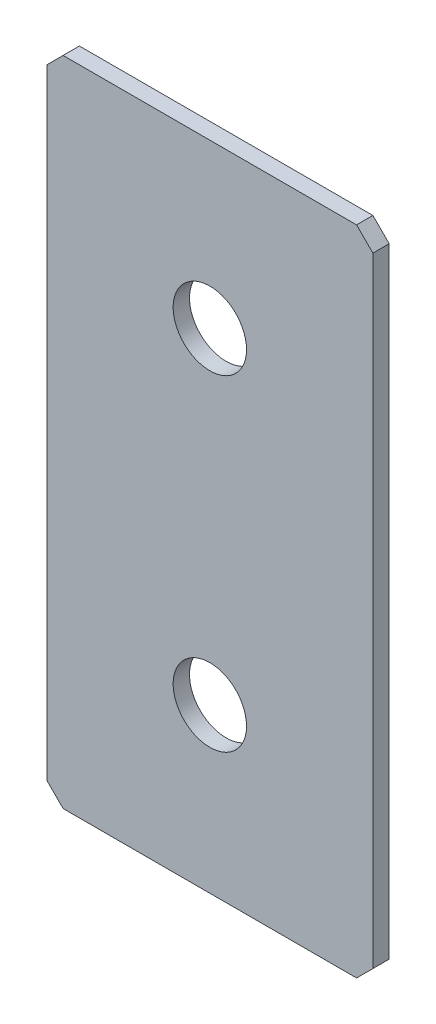
ISO-10303-21;
HEADER;
FILE_DESCRIPTION(('STEP AP214'),'2;1');
FILE_NAME('part.step','',(''),(''),'','','');
FILE_SCHEMA(('AUTOMOTIVE_DESIGN { 1 0 10303 214 1 1 1 1 }'));
ENDSEC;
DATA;
#1=APPLICATION_CONTEXT('core data for automotive mechanical design processes');
#2=APPLICATION_PROTOCOL_DEFINITION('international standard','automotive_design',2000,#1);
#3=PRODUCT_CONTEXT('',#1,'mechanical');
#4=PRODUCT('Part','Part','',(#3));
#5=PRODUCT_RELATED_PRODUCT_CATEGORY('part','',(#4));
#6=PRODUCT_DEFINITION_FORMATION('','',#4);
#7=PRODUCT_DEFINITION_CONTEXT('part definition',#1,'design');
#8=PRODUCT_DEFINITION('design','',#6,#7);
#9=PRODUCT_DEFINITION_SHAPE('','',#8);
#10=(LENGTH_UNIT() NAMED_UNIT(*) SI_UNIT(.MILLI.,.METRE.));
#11=(NAMED_UNIT(*) PLANE_ANGLE_UNIT() SI_UNIT($,.RADIAN.));
#12=(NAMED_UNIT(*) SI_UNIT($,.STERADIAN.) SOLID_ANGLE_UNIT());
#13=UNCERTAINTY_MEASURE_WITH_UNIT(LENGTH_MEASURE(1.E-05),#10,'distance_accuracy_value','');
#14=(GEOMETRIC_REPRESENTATION_CONTEXT(3) GLOBAL_UNCERTAINTY_ASSIGNED_CONTEXT((#13)) GLOBAL_UNIT_ASSIGNED_CONTEXT((#10,
#11,#12)) REPRESENTATION_CONTEXT('',''));
#15=CARTESIAN_POINT('',(0.,0.,0.));
#16=DIRECTION('',(0.,0.,1.));
#17=DIRECTION('',(1.,0.,0.));
#18=AXIS2_PLACEMENT_3D('',#15,#16,#17);
#19=CARTESIAN_POINT('',(20.,-40.,2.));
#20=DIRECTION('',(-1.,0.,0.));
#21=DIRECTION('',(0.,0.,1.));
#22=AXIS2_PLACEMENT_3D('',#19,#20,#21);
#23=PLANE('',#22);
#24=DIRECTION('',(0.,1.,0.));
#25=VECTOR('',#24,1.);
#26=CARTESIAN_POINT('',(20.,-40.,2.));
#27=LINE('',#26,#25);
#28=CARTESIAN_POINT('',(20.,-38.,2.));
#29=VERTEX_POINT('',#28);
#30=CARTESIAN_POINT('',(20.,38.,2.));
#31=VERTEX_POINT('',#30);
#32=EDGE_CURVE('E128',#29,#31,#27,.T.);
#33=ORIENTED_EDGE('',*,*,#32,.F.);
#34=DIRECTION('',(0.,0.,-1.));
#35=VECTOR('',#34,1.);
#36=CARTESIAN_POINT('',(20.,-38.,2.));
#37=LINE('',#36,#35);
#38=CARTESIAN_POINT('',(20.,-38.,0.));
#39=VERTEX_POINT('',#38);
#40=EDGE_CURVE('E154',#29,#39,#37,.T.);
#41=ORIENTED_EDGE('',*,*,#40,.T.);
#42=DIRECTION('',(0.,1.,0.));
#43=VECTOR('',#42,1.);
#44=CARTESIAN_POINT('',(20.,-40.,0.));
#45=LINE('',#44,#43);
#46=CARTESIAN_POINT('',(20.,38.,0.));
#47=VERTEX_POINT('',#46);
#48=EDGE_CURVE('E162',#39,#47,#45,.T.);
#49=ORIENTED_EDGE('',*,*,#48,.T.);
#50=DIRECTION('',(0.,0.,1.));
#51=VECTOR('',#50,1.);
#52=CARTESIAN_POINT('',(20.,38.,2.));
#53=LINE('',#52,#51);
#54=EDGE_CURVE('E152',#47,#31,#53,.T.);
#55=ORIENTED_EDGE('',*,*,#54,.T.);
#56=EDGE_LOOP('',(#33,#41,#49,#55));
#57=FACE_BOUND('',#56,.T.);
#58=ADVANCED_FACE('F37',(#57),#23,.F.);
#59=CARTESIAN_POINT('',(-20.,40.,2.));
#60=DIRECTION('',(0.,-1.,0.));
#61=DIRECTION('',(0.,0.,-1.));
#62=AXIS2_PLACEMENT_3D('',#59,#60,#61);
#63=PLANE('',#62);
#64=DIRECTION('',(-1.,0.,0.));
#65=VECTOR('',#64,1.);
#66=CARTESIAN_POINT('',(-20.,40.,0.));
#67=LINE('',#66,#65);
#68=CARTESIAN_POINT('',(18.,40.,0.));
#69=VERTEX_POINT('',#68);
#70=CARTESIAN_POINT('',(-18.,40.,0.));
#71=VERTEX_POINT('',#70);
#72=EDGE_CURVE('E133',#69,#71,#67,.T.);
#73=ORIENTED_EDGE('',*,*,#72,.T.);
#74=DIRECTION('',(0.,0.,1.));
#75=VECTOR('',#74,1.);
#76=CARTESIAN_POINT('',(-18.,40.,2.));
#77=LINE('',#76,#75);
#78=CARTESIAN_POINT('',(-18.,40.,2.));
#79=VERTEX_POINT('',#78);
#80=EDGE_CURVE('E11',#71,#79,#77,.T.);
#81=ORIENTED_EDGE('',*,*,#80,.T.);
#82=DIRECTION('',(-1.,0.,0.));
#83=VECTOR('',#82,1.);
#84=CARTESIAN_POINT('',(-20.,40.,2.));
#85=LINE('',#84,#83);
#86=CARTESIAN_POINT('',(18.,40.,2.));
#87=VERTEX_POINT('',#86);
#88=EDGE_CURVE('E131',#87,#79,#85,.T.);
#89=ORIENTED_EDGE('',*,*,#88,.F.);
#90=DIRECTION('',(0.,0.,-1.));
#91=VECTOR('',#90,1.);
#92=CARTESIAN_POINT('',(18.,40.,2.));
#93=LINE('',#92,#91);
#94=EDGE_CURVE('E45',#87,#69,#93,.T.);
#95=ORIENTED_EDGE('',*,*,#94,.T.);
#96=EDGE_LOOP('',(#73,#81,#89,#95));
#97=FACE_BOUND('',#96,.T.);
#98=ADVANCED_FACE('F159',(#97),#63,.F.);
#99=CARTESIAN_POINT('',(-20.,-40.,2.));
#100=DIRECTION('',(1.,0.,0.));
#101=DIRECTION('',(0.,0.,-1.));
#102=AXIS2_PLACEMENT_3D('',#99,#100,#101);
#103=PLANE('',#102);
#104=DIRECTION('',(0.,-1.,0.));
#105=VECTOR('',#104,1.);
#106=CARTESIAN_POINT('',(-20.,-40.,0.));
#107=LINE('',#106,#105);
#108=CARTESIAN_POINT('',(-20.,38.,0.));
#109=VERTEX_POINT('',#108);
#110=CARTESIAN_POINT('',(-20.,-38.,0.));
#111=VERTEX_POINT('',#110);
#112=EDGE_CURVE('E129',#109,#111,#107,.T.);
#113=ORIENTED_EDGE('',*,*,#112,.T.);
#114=DIRECTION('',(0.,0.,1.));
#115=VECTOR('',#114,1.);
#116=CARTESIAN_POINT('',(-20.,-38.,2.));
#117=LINE('',#116,#115);
#118=CARTESIAN_POINT('',(-20.,-38.,2.));
#119=VERTEX_POINT('',#118);
#120=EDGE_CURVE('E107',#111,#119,#117,.T.);
#121=ORIENTED_EDGE('',*,*,#120,.T.);
#122=DIRECTION('',(0.,-1.,0.));
#123=VECTOR('',#122,1.);
#124=CARTESIAN_POINT('',(-20.,-40.,2.));
#125=LINE('',#124,#123);
#126=CARTESIAN_POINT('',(-20.,38.,2.));
#127=VERTEX_POINT('',#126);
#128=EDGE_CURVE('E167',#127,#119,#125,.T.);
#129=ORIENTED_EDGE('',*,*,#128,.F.);
#130=DIRECTION('',(0.,0.,-1.));
#131=VECTOR('',#130,1.);
#132=CARTESIAN_POINT('',(-20.,38.,2.));
#133=LINE('',#132,#131);
#134=EDGE_CURVE('E112',#127,#109,#133,.T.);
#135=ORIENTED_EDGE('',*,*,#134,.T.);
#136=EDGE_LOOP('',(#113,#121,#129,#135));
#137=FACE_BOUND('',#136,.T.);
#138=ADVANCED_FACE('F194',(#137),#103,.F.);
#139=CARTESIAN_POINT('',(-20.,-40.,2.));
#140=DIRECTION('',(0.,1.,0.));
#141=DIRECTION('',(0.,0.,1.));
#142=AXIS2_PLACEMENT_3D('',#139,#140,#141);
#143=PLANE('',#142);
#144=DIRECTION('',(1.,0.,0.));
#145=VECTOR('',#144,1.);
#146=CARTESIAN_POINT('',(-20.,-40.,2.));
#147=LINE('',#146,#145);
#148=CARTESIAN_POINT('',(-18.,-40.,2.));
#149=VERTEX_POINT('',#148);
#150=CARTESIAN_POINT('',(18.,-40.,2.));
#151=VERTEX_POINT('',#150);
#152=EDGE_CURVE('E122',#149,#151,#147,.T.);
#153=ORIENTED_EDGE('',*,*,#152,.F.);
#154=DIRECTION('',(0.,0.,-1.));
#155=VECTOR('',#154,1.);
#156=CARTESIAN_POINT('',(-18.,-40.,2.));
#157=LINE('',#156,#155);
#158=CARTESIAN_POINT('',(-18.,-40.,0.));
#159=VERTEX_POINT('',#158);
#160=EDGE_CURVE('E106',#149,#159,#157,.T.);
#161=ORIENTED_EDGE('',*,*,#160,.T.);
#162=DIRECTION('',(1.,0.,0.));
#163=VECTOR('',#162,1.);
#164=CARTESIAN_POINT('',(-20.,-40.,0.));
#165=LINE('',#164,#163);
#166=CARTESIAN_POINT('',(18.,-40.,0.));
#167=VERTEX_POINT('',#166);
#168=EDGE_CURVE('E119',#159,#167,#165,.T.);
#169=ORIENTED_EDGE('',*,*,#168,.T.);
#170=DIRECTION('',(0.,0.,1.));
#171=VECTOR('',#170,1.);
#172=CARTESIAN_POINT('',(18.,-40.,2.));
#173=LINE('',#172,#171);
#174=EDGE_CURVE('E124',#167,#151,#173,.T.);
#175=ORIENTED_EDGE('',*,*,#174,.T.);
#176=EDGE_LOOP('',(#153,#161,#169,#175));
#177=FACE_BOUND('',#176,.T.);
#178=ADVANCED_FACE('F118',(#177),#143,.F.);
#179=CARTESIAN_POINT('',(0.,0.,2.));
#180=DIRECTION('',(0.,0.,-1.));
#181=DIRECTION('',(-1.,0.,0.));
#182=AXIS2_PLACEMENT_3D('',#179,#180,#181);
#183=PLANE('',#182);
#184=CARTESIAN_POINT('',(0.,20.,2.));
#185=DIRECTION('',(0.,0.,1.));
#186=DIRECTION('',(1.,0.,0.));
#187=AXIS2_PLACEMENT_3D('',#184,#185,#186);
#188=CIRCLE('',#187,4.5);
#189=CARTESIAN_POINT('',(4.50000000000001,20.,2.));
#190=VERTEX_POINT('',#189);
#191=EDGE_CURVE('E179',#190,#190,#188,.T.);
#192=ORIENTED_EDGE('',*,*,#191,.F.);
#193=EDGE_LOOP('',(#192));
#194=FACE_BOUND('',#193,.T.);
#195=CARTESIAN_POINT('',(0.,-20.,2.));
#196=DIRECTION('',(0.,0.,1.));
#197=DIRECTION('',(1.,0.,0.));
#198=AXIS2_PLACEMENT_3D('',#195,#196,#197);
#199=CIRCLE('',#198,4.5);
#200=CARTESIAN_POINT('',(4.50000000000001,-20.,2.));
#201=VERTEX_POINT('',#200);
#202=EDGE_CURVE('E173',#201,#201,#199,.T.);
#203=ORIENTED_EDGE('',*,*,#202,.F.);
#204=EDGE_LOOP('',(#203));
#205=FACE_BOUND('',#204,.T.);
#206=ORIENTED_EDGE('',*,*,#128,.T.);
#207=DIRECTION('',(-0.707106781186545,0.70710678118655,0.));
#208=VECTOR('',#207,1.);
#209=CARTESIAN_POINT('',(-18.,-40.,2.));
#210=LINE('',#209,#208);
#211=EDGE_CURVE('E150',#119,#149,#210,.F.);
#212=ORIENTED_EDGE('',*,*,#211,.T.);
#213=ORIENTED_EDGE('',*,*,#152,.T.);
#214=DIRECTION('',(-0.70710678118655,-0.707106781186545,0.));
#215=VECTOR('',#214,1.);
#216=CARTESIAN_POINT('',(20.,-38.,2.));
#217=LINE('',#216,#215);
#218=EDGE_CURVE('E148',#151,#29,#217,.F.);
#219=ORIENTED_EDGE('',*,*,#218,.T.);
#220=ORIENTED_EDGE('',*,*,#32,.T.);
#221=DIRECTION('',(0.707106781186545,-0.70710678118655,0.));
#222=VECTOR('',#221,1.);
#223=CARTESIAN_POINT('',(18.,40.,2.));
#224=LINE('',#223,#222);
#225=EDGE_CURVE('E57',#31,#87,#224,.F.);
#226=ORIENTED_EDGE('',*,*,#225,.T.);
#227=ORIENTED_EDGE('',*,*,#88,.T.);
#228=DIRECTION('',(0.70710678118655,0.707106781186545,0.));
#229=VECTOR('',#228,1.);
#230=CARTESIAN_POINT('',(-20.,38.,2.));
#231=LINE('',#230,#229);
#232=EDGE_CURVE('E146',#79,#127,#231,.F.);
#233=ORIENTED_EDGE('',*,*,#232,.T.);
#234=EDGE_LOOP('',(#206,#212,#213,#219,#220,#226,#227,#233));
#235=FACE_BOUND('',#234,.T.);
#236=ADVANCED_FACE('F185',(#194,#205,#235),#183,.F.);
#237=CARTESIAN_POINT('',(0.,0.,0.));
#238=DIRECTION('',(0.,0.,-1.));
#239=DIRECTION('',(-1.,0.,0.));
#240=AXIS2_PLACEMENT_3D('',#237,#238,#239);
#241=PLANE('',#240);
#242=CARTESIAN_POINT('',(0.,20.,0.));
#243=DIRECTION('',(0.,0.,1.));
#244=DIRECTION('',(1.,0.,0.));
#245=AXIS2_PLACEMENT_3D('',#242,#243,#244);
#246=CIRCLE('',#245,4.5);
#247=CARTESIAN_POINT('',(4.50000000000001,20.,0.));
#248=VERTEX_POINT('',#247);
#249=EDGE_CURVE('E176',#248,#248,#246,.T.);
#250=ORIENTED_EDGE('',*,*,#249,.T.);
#251=EDGE_LOOP('',(#250));
#252=FACE_BOUND('',#251,.T.);
#253=CARTESIAN_POINT('',(0.,-20.,0.));
#254=DIRECTION('',(0.,0.,1.));
#255=DIRECTION('',(1.,0.,0.));
#256=AXIS2_PLACEMENT_3D('',#253,#254,#255);
#257=CIRCLE('',#256,4.5);
#258=CARTESIAN_POINT('',(4.50000000000001,-20.,0.));
#259=VERTEX_POINT('',#258);
#260=EDGE_CURVE('E163',#259,#259,#257,.T.);
#261=ORIENTED_EDGE('',*,*,#260,.T.);
#262=EDGE_LOOP('',(#261));
#263=FACE_BOUND('',#262,.T.);
#264=ORIENTED_EDGE('',*,*,#168,.F.);
#265=DIRECTION('',(0.707106781186545,-0.70710678118655,0.));
#266=VECTOR('',#265,1.);
#267=CARTESIAN_POINT('',(-29.0000000000001,-28.9999999999999,0.));
#268=LINE('',#267,#266);
#269=EDGE_CURVE('E102',#159,#111,#268,.F.);
#270=ORIENTED_EDGE('',*,*,#269,.T.);
#271=ORIENTED_EDGE('',*,*,#112,.F.);
#272=DIRECTION('',(-0.70710678118655,-0.707106781186545,0.));
#273=VECTOR('',#272,1.);
#274=CARTESIAN_POINT('',(-28.9999999999999,29.0000000000001,0.));
#275=LINE('',#274,#273);
#276=EDGE_CURVE('E139',#109,#71,#275,.F.);
#277=ORIENTED_EDGE('',*,*,#276,.T.);
#278=ORIENTED_EDGE('',*,*,#72,.F.);
#279=DIRECTION('',(-0.707106781186545,0.70710678118655,0.));
#280=VECTOR('',#279,1.);
#281=CARTESIAN_POINT('',(29.,28.9999999999998,0.));
#282=LINE('',#281,#280);
#283=EDGE_CURVE('E123',#69,#47,#282,.F.);
#284=ORIENTED_EDGE('',*,*,#283,.T.);
#285=ORIENTED_EDGE('',*,*,#48,.F.);
#286=DIRECTION('',(0.70710678118655,0.707106781186545,0.));
#287=VECTOR('',#286,1.);
#288=CARTESIAN_POINT('',(28.9999999999999,-29.0000000000001,0.));
#289=LINE('',#288,#287);
#290=EDGE_CURVE('E113',#39,#167,#289,.F.);
#291=ORIENTED_EDGE('',*,*,#290,.T.);
#292=EDGE_LOOP('',(#264,#270,#271,#277,#278,#284,#285,#291));
#293=FACE_BOUND('',#292,.T.);
#294=ADVANCED_FACE('F126',(#252,#263,#293),#241,.T.);
#295=CARTESIAN_POINT('',(-18.,-40.,2.));
#296=DIRECTION('',(0.70710678118655,0.707106781186545,0.));
#297=DIRECTION('',(0.,0.,-1.));
#298=AXIS2_PLACEMENT_3D('',#295,#296,#297);
#299=PLANE('',#298);
#300=ORIENTED_EDGE('',*,*,#211,.F.);
#301=ORIENTED_EDGE('',*,*,#120,.F.);
#302=ORIENTED_EDGE('',*,*,#269,.F.);
#303=ORIENTED_EDGE('',*,*,#160,.F.);
#304=EDGE_LOOP('',(#300,#301,#302,#303));
#305=FACE_BOUND('',#304,.T.);
#306=ADVANCED_FACE('F105',(#305),#299,.F.);
#307=CARTESIAN_POINT('',(20.,-38.,2.));
#308=DIRECTION('',(-0.707106781186545,0.70710678118655,0.));
#309=DIRECTION('',(0.,0.,-1.));
#310=AXIS2_PLACEMENT_3D('',#307,#308,#309);
#311=PLANE('',#310);
#312=ORIENTED_EDGE('',*,*,#218,.F.);
#313=ORIENTED_EDGE('',*,*,#174,.F.);
#314=ORIENTED_EDGE('',*,*,#290,.F.);
#315=ORIENTED_EDGE('',*,*,#40,.F.);
#316=EDGE_LOOP('',(#312,#313,#314,#315));
#317=FACE_BOUND('',#316,.T.);
#318=ADVANCED_FACE('F198',(#317),#311,.F.);
#319=CARTESIAN_POINT('',(-20.,38.,2.));
#320=DIRECTION('',(0.707106781186545,-0.70710678118655,0.));
#321=DIRECTION('',(0.,0.,-1.));
#322=AXIS2_PLACEMENT_3D('',#319,#320,#321);
#323=PLANE('',#322);
#324=ORIENTED_EDGE('',*,*,#232,.F.);
#325=ORIENTED_EDGE('',*,*,#80,.F.);
#326=ORIENTED_EDGE('',*,*,#276,.F.);
#327=ORIENTED_EDGE('',*,*,#134,.F.);
#328=EDGE_LOOP('',(#324,#325,#326,#327));
#329=FACE_BOUND('',#328,.T.);
#330=ADVANCED_FACE('F196',(#329),#323,.F.);
#331=CARTESIAN_POINT('',(18.,40.,2.));
#332=DIRECTION('',(-0.70710678118655,-0.707106781186545,0.));
#333=DIRECTION('',(0.,0.,-1.));
#334=AXIS2_PLACEMENT_3D('',#331,#332,#333);
#335=PLANE('',#334);
#336=ORIENTED_EDGE('',*,*,#225,.F.);
#337=ORIENTED_EDGE('',*,*,#54,.F.);
#338=ORIENTED_EDGE('',*,*,#283,.F.);
#339=ORIENTED_EDGE('',*,*,#94,.F.);
#340=EDGE_LOOP('',(#336,#337,#338,#339));
#341=FACE_BOUND('',#340,.T.);
#342=ADVANCED_FACE('F39',(#341),#335,.F.);
#343=CARTESIAN_POINT('',(0.,-20.,2.));
#344=DIRECTION('',(0.,0.,1.));
#345=DIRECTION('',(1.,0.,0.));
#346=AXIS2_PLACEMENT_3D('',#343,#344,#345);
#347=CYLINDRICAL_SURFACE('',#346,4.5);
#348=ORIENTED_EDGE('',*,*,#260,.F.);
#349=EDGE_LOOP('',(#348));
#350=FACE_BOUND('',#349,.T.);
#351=ORIENTED_EDGE('',*,*,#202,.T.);
#352=EDGE_LOOP('',(#351));
#353=FACE_BOUND('',#352,.T.);
#354=ADVANCED_FACE('F203',(#350,#353),#347,.F.);
#355=CARTESIAN_POINT('',(0.,20.,2.));
#356=DIRECTION('',(0.,0.,1.));
#357=DIRECTION('',(1.,0.,0.));
#358=AXIS2_PLACEMENT_3D('',#355,#356,#357);
#359=CYLINDRICAL_SURFACE('',#358,4.5);
#360=ORIENTED_EDGE('',*,*,#249,.F.);
#361=EDGE_LOOP('',(#360));
#362=FACE_BOUND('',#361,.T.);
#363=ORIENTED_EDGE('',*,*,#191,.T.);
#364=EDGE_LOOP('',(#363));
#365=FACE_BOUND('',#364,.T.);
#366=ADVANCED_FACE('F183',(#362,#365),#359,.F.);
#367=CLOSED_SHELL('',(#58,#98,#138,#178,#236,#294,#306,#318,#330,#342,#354,#366));
#368=MANIFOLD_SOLID_BREP('B2',#367);
#369=ADVANCED_BREP_SHAPE_REPRESENTATION('',(#18,#368),#14);
#370=SHAPE_DEFINITION_REPRESENTATION(#9,#369);
ENDSEC;
END-ISO-10303-21;
